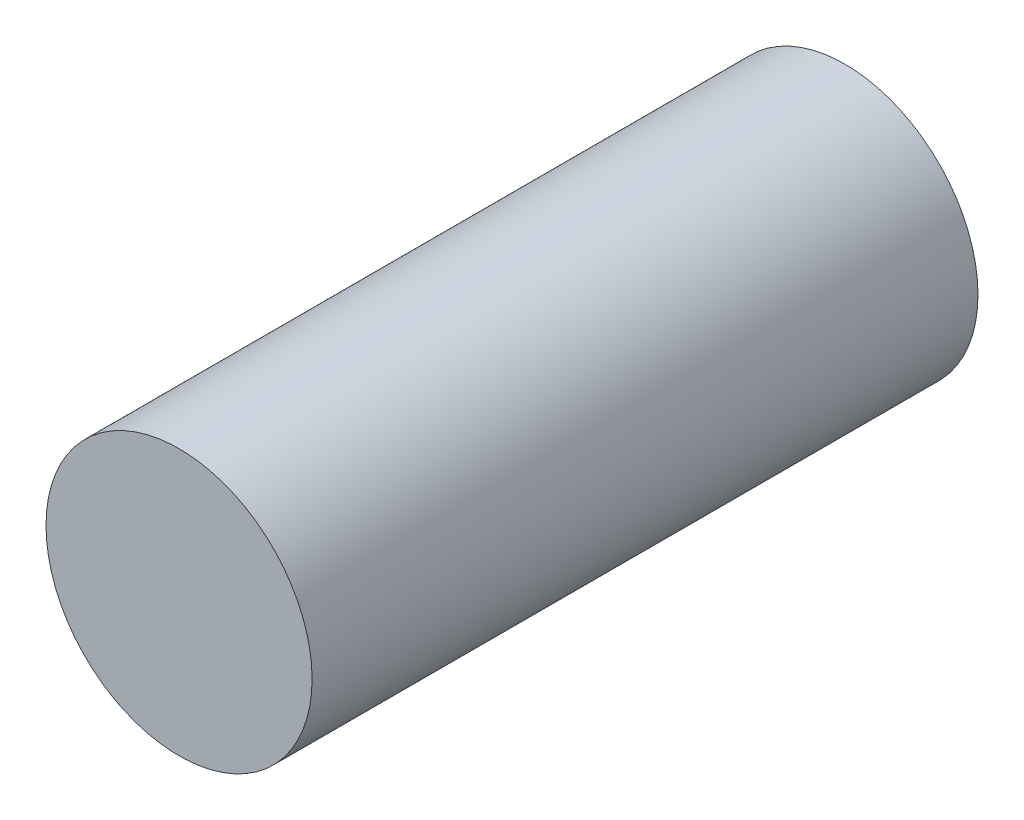
ISO-10303-21;
HEADER;
FILE_DESCRIPTION(('STEP AP214'),'2;1');
FILE_NAME('part.step','',(''),(''),'','','');
FILE_SCHEMA(('AUTOMOTIVE_DESIGN { 1 0 10303 214 1 1 1 1 }'));
ENDSEC;
DATA;
#1=APPLICATION_CONTEXT('core data for automotive mechanical design processes');
#2=APPLICATION_PROTOCOL_DEFINITION('international standard','automotive_design',2000,#1);
#3=PRODUCT_CONTEXT('',#1,'mechanical');
#4=PRODUCT('Part','Part','',(#3));
#5=PRODUCT_RELATED_PRODUCT_CATEGORY('part','',(#4));
#6=PRODUCT_DEFINITION_FORMATION('','',#4);
#7=PRODUCT_DEFINITION_CONTEXT('part definition',#1,'design');
#8=PRODUCT_DEFINITION('design','',#6,#7);
#9=PRODUCT_DEFINITION_SHAPE('','',#8);
#10=(LENGTH_UNIT() NAMED_UNIT(*) SI_UNIT(.MILLI.,.METRE.));
#11=(NAMED_UNIT(*) PLANE_ANGLE_UNIT() SI_UNIT($,.RADIAN.));
#12=(NAMED_UNIT(*) SI_UNIT($,.STERADIAN.) SOLID_ANGLE_UNIT());
#13=UNCERTAINTY_MEASURE_WITH_UNIT(LENGTH_MEASURE(1.E-05),#10,'distance_accuracy_value','');
#14=(GEOMETRIC_REPRESENTATION_CONTEXT(3) GLOBAL_UNCERTAINTY_ASSIGNED_CONTEXT((#13)) GLOBAL_UNIT_ASSIGNED_CONTEXT((#10,
#11,#12)) REPRESENTATION_CONTEXT('',''));
#15=CARTESIAN_POINT('',(0.,0.,0.));
#16=DIRECTION('',(0.,0.,1.));
#17=DIRECTION('',(1.,0.,0.));
#18=AXIS2_PLACEMENT_3D('',#15,#16,#17);
#19=CARTESIAN_POINT('',(0.1999996,0.,1.00099876));
#20=DIRECTION('',(0.,0.,-1.));
#21=DIRECTION('',(0.,-1.,0.));
#22=AXIS2_PLACEMENT_3D('',#19,#20,#21);
#23=PLANE('',#22);
#24=CARTESIAN_POINT('',(0.,0.,1.00099876));
#25=DIRECTION('',(0.,0.,1.));
#26=DIRECTION('',(1.,0.,0.));
#27=AXIS2_PLACEMENT_3D('',#24,#25,#26);
#28=CIRCLE('',#27,0.1999996);
#29=CARTESIAN_POINT('',(0.1999996,0.,1.00099876));
#30=VERTEX_POINT('',#29);
#31=EDGE_CURVE('E11',#30,#30,#28,.T.);
#32=ORIENTED_EDGE('',*,*,#31,.T.);
#33=EDGE_LOOP('',(#32));
#34=FACE_BOUND('',#33,.T.);
#35=ADVANCED_FACE('F16',(#34),#23,.F.);
#36=CARTESIAN_POINT('',(0.1999996,0.,0.));
#37=DIRECTION('',(0.,0.,-1.));
#38=DIRECTION('',(0.,-1.,0.));
#39=AXIS2_PLACEMENT_3D('',#36,#37,#38);
#40=PLANE('',#39);
#41=CARTESIAN_POINT('',(0.,0.,0.));
#42=DIRECTION('',(0.,0.,1.));
#43=DIRECTION('',(1.,0.,0.));
#44=AXIS2_PLACEMENT_3D('',#41,#42,#43);
#45=CIRCLE('',#44,0.1999996);
#46=CARTESIAN_POINT('',(0.1999996,0.,0.));
#47=VERTEX_POINT('',#46);
#48=EDGE_CURVE('E42',#47,#47,#45,.T.);
#49=ORIENTED_EDGE('',*,*,#48,.F.);
#50=EDGE_LOOP('',(#49));
#51=FACE_BOUND('',#50,.T.);
#52=ADVANCED_FACE('F18',(#51),#40,.T.);
#53=CARTESIAN_POINT('',(0.,0.,0.));
#54=DIRECTION('',(0.,0.,-1.));
#55=DIRECTION('',(1.,0.,0.));
#56=AXIS2_PLACEMENT_3D('',#53,#54,#55);
#57=CYLINDRICAL_SURFACE('',#56,0.1999996);
#58=ORIENTED_EDGE('',*,*,#48,.T.);
#59=DIRECTION('',(0.,0.,1.));
#60=VECTOR('',#59,1.);
#61=CARTESIAN_POINT('',(0.1999996,0.,0.));
#62=LINE('',#61,#60);
#63=EDGE_CURVE('E25',#47,#30,#62,.T.);
#64=ORIENTED_EDGE('',*,*,#63,.T.);
#65=ORIENTED_EDGE('',*,*,#31,.F.);
#66=ORIENTED_EDGE('',*,*,#63,.F.);
#67=EDGE_LOOP('',(#58,#64,#65,#66));
#68=FACE_BOUND('',#67,.T.);
#69=ADVANCED_FACE('F40',(#68),#57,.T.);
#70=CLOSED_SHELL('',(#35,#52,#69));
#71=MANIFOLD_SOLID_BREP('B1',#70);
#72=ADVANCED_BREP_SHAPE_REPRESENTATION('',(#18,#71),#14);
#73=SHAPE_DEFINITION_REPRESENTATION(#9,#72);
ENDSEC;
END-ISO-10303-21;
